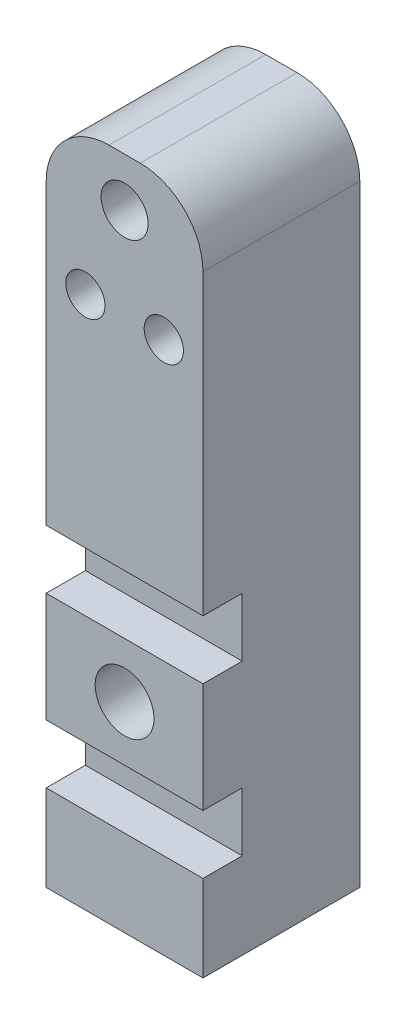
ISO-10303-21;
HEADER;
FILE_DESCRIPTION(('STEP AP214'),'2;1');
FILE_NAME('part.step','',(''),(''),'','','');
FILE_SCHEMA(('AUTOMOTIVE_DESIGN { 1 0 10303 214 1 1 1 1 }'));
ENDSEC;
DATA;
#1=APPLICATION_CONTEXT('core data for automotive mechanical design processes');
#2=APPLICATION_PROTOCOL_DEFINITION('international standard','automotive_design',2000,#1);
#3=PRODUCT_CONTEXT('',#1,'mechanical');
#4=PRODUCT('Part','Part','',(#3));
#5=PRODUCT_RELATED_PRODUCT_CATEGORY('part','',(#4));
#6=PRODUCT_DEFINITION_FORMATION('','',#4);
#7=PRODUCT_DEFINITION_CONTEXT('part definition',#1,'design');
#8=PRODUCT_DEFINITION('design','',#6,#7);
#9=PRODUCT_DEFINITION_SHAPE('','',#8);
#10=(LENGTH_UNIT() NAMED_UNIT(*) SI_UNIT(.MILLI.,.METRE.));
#11=(NAMED_UNIT(*) PLANE_ANGLE_UNIT() SI_UNIT($,.RADIAN.));
#12=(NAMED_UNIT(*) SI_UNIT($,.STERADIAN.) SOLID_ANGLE_UNIT());
#13=UNCERTAINTY_MEASURE_WITH_UNIT(LENGTH_MEASURE(1.E-05),#10,'distance_accuracy_value','');
#14=(GEOMETRIC_REPRESENTATION_CONTEXT(3) GLOBAL_UNCERTAINTY_ASSIGNED_CONTEXT((#13)) GLOBAL_UNIT_ASSIGNED_CONTEXT((#10,
#11,#12)) REPRESENTATION_CONTEXT('',''));
#15=CARTESIAN_POINT('',(0.,0.,0.));
#16=DIRECTION('',(0.,0.,1.));
#17=DIRECTION('',(1.,0.,0.));
#18=AXIS2_PLACEMENT_3D('',#15,#16,#17);
#19=CARTESIAN_POINT('',(0.,0.,7.5));
#20=DIRECTION('',(0.,0.,-1.));
#21=DIRECTION('',(-1.,0.,0.));
#22=AXIS2_PLACEMENT_3D('',#19,#20,#21);
#23=PLANE('',#22);
#24=DIRECTION('',(1.,0.,0.));
#25=VECTOR('',#24,1.);
#26=CARTESIAN_POINT('',(0.,-12.25,7.5));
#27=LINE('',#26,#25);
#28=CARTESIAN_POINT('',(-5.,-12.25,7.5));
#29=VERTEX_POINT('',#28);
#30=CARTESIAN_POINT('',(5.,-12.25,7.5));
#31=VERTEX_POINT('',#30);
#32=EDGE_CURVE('E11',#29,#31,#27,.T.);
#33=ORIENTED_EDGE('',*,*,#32,.F.);
#34=DIRECTION('',(0.,1.,0.));
#35=VECTOR('',#34,1.);
#36=CARTESIAN_POINT('',(-5.,-12.2260266892239,7.5));
#37=LINE('',#36,#35);
#38=CARTESIAN_POINT('',(-5.,-16.,7.5));
#39=VERTEX_POINT('',#38);
#40=EDGE_CURVE('E64',#39,#29,#37,.T.);
#41=ORIENTED_EDGE('',*,*,#40,.F.);
#42=DIRECTION('',(-1.,0.,0.));
#43=VECTOR('',#42,1.);
#44=CARTESIAN_POINT('',(5.,-16.,7.5));
#45=LINE('',#44,#43);
#46=CARTESIAN_POINT('',(5.,-16.,7.5));
#47=VERTEX_POINT('',#46);
#48=EDGE_CURVE('E264',#47,#39,#45,.T.);
#49=ORIENTED_EDGE('',*,*,#48,.F.);
#50=DIRECTION('',(0.,-1.,0.));
#51=VECTOR('',#50,1.);
#52=CARTESIAN_POINT('',(5.,-12.2260266892239,7.5));
#53=LINE('',#52,#51);
#54=EDGE_CURVE('E261',#31,#47,#53,.T.);
#55=ORIENTED_EDGE('',*,*,#54,.F.);
#56=EDGE_LOOP('',(#33,#41,#49,#55));
#57=FACE_BOUND('',#56,.T.);
#58=ADVANCED_FACE('F41',(#57),#23,.F.);
#59=CARTESIAN_POINT('',(0.,-16.,10.));
#60=DIRECTION('',(0.,1.,0.));
#61=DIRECTION('',(-1.,0.,0.));
#62=AXIS2_PLACEMENT_3D('',#59,#60,#61);
#63=PLANE('',#62);
#64=DIRECTION('',(0.,0.,-1.));
#65=VECTOR('',#64,1.);
#66=CARTESIAN_POINT('',(5.,-16.,10.));
#67=LINE('',#66,#65);
#68=CARTESIAN_POINT('',(5.,-16.,10.));
#69=VERTEX_POINT('',#68);
#70=EDGE_CURVE('E283',#69,#47,#67,.T.);
#71=ORIENTED_EDGE('',*,*,#70,.T.);
#72=ORIENTED_EDGE('',*,*,#48,.T.);
#73=DIRECTION('',(0.,0.,-1.));
#74=VECTOR('',#73,1.);
#75=CARTESIAN_POINT('',(-5.,-16.,10.));
#76=LINE('',#75,#74);
#77=CARTESIAN_POINT('',(-5.,-16.,10.));
#78=VERTEX_POINT('',#77);
#79=EDGE_CURVE('E50',#78,#39,#76,.T.);
#80=ORIENTED_EDGE('',*,*,#79,.F.);
#81=DIRECTION('',(1.,0.,0.));
#82=VECTOR('',#81,1.);
#83=CARTESIAN_POINT('',(0.,-16.,10.));
#84=LINE('',#83,#82);
#85=EDGE_CURVE('E268',#78,#69,#84,.T.);
#86=ORIENTED_EDGE('',*,*,#85,.T.);
#87=EDGE_LOOP('',(#71,#72,#80,#86));
#88=FACE_BOUND('',#87,.T.);
#89=ADVANCED_FACE('F43',(#88),#63,.T.);
#90=CARTESIAN_POINT('',(-5.,0.,10.));
#91=DIRECTION('',(1.,0.,0.));
#92=DIRECTION('',(0.,1.,0.));
#93=AXIS2_PLACEMENT_3D('',#90,#91,#92);
#94=PLANE('',#93);
#95=DIRECTION('',(0.,0.,-1.));
#96=VECTOR('',#95,1.);
#97=CARTESIAN_POINT('',(-5.,17.5,0.));
#98=LINE('',#97,#96);
#99=CARTESIAN_POINT('',(-5.,17.5,10.));
#100=VERTEX_POINT('',#99);
#101=CARTESIAN_POINT('',(-5.,17.5,0.));
#102=VERTEX_POINT('',#101);
#103=EDGE_CURVE('E176',#100,#102,#98,.T.);
#104=ORIENTED_EDGE('',*,*,#103,.T.);
#105=DIRECTION('',(0.,-1.,0.));
#106=VECTOR('',#105,1.);
#107=CARTESIAN_POINT('',(-5.,0.,0.));
#108=LINE('',#107,#106);
#109=CARTESIAN_POINT('',(-5.,-21.5,0.));
#110=VERTEX_POINT('',#109);
#111=EDGE_CURVE('E267',#102,#110,#108,.T.);
#112=ORIENTED_EDGE('',*,*,#111,.T.);
#113=DIRECTION('',(0.,0.,-1.));
#114=VECTOR('',#113,1.);
#115=CARTESIAN_POINT('',(-5.,-21.5,10.));
#116=LINE('',#115,#114);
#117=CARTESIAN_POINT('',(-5.,-21.5,10.));
#118=VERTEX_POINT('',#117);
#119=EDGE_CURVE('E299',#118,#110,#116,.T.);
#120=ORIENTED_EDGE('',*,*,#119,.F.);
#121=DIRECTION('',(0.,-1.,0.));
#122=VECTOR('',#121,1.);
#123=CARTESIAN_POINT('',(-5.,0.,10.));
#124=LINE('',#123,#122);
#125=EDGE_CURVE('E272',#78,#118,#124,.T.);
#126=ORIENTED_EDGE('',*,*,#125,.F.);
#127=ORIENTED_EDGE('',*,*,#79,.T.);
#128=ORIENTED_EDGE('',*,*,#40,.T.);
#129=DIRECTION('',(0.,0.,-1.));
#130=VECTOR('',#129,1.);
#131=CARTESIAN_POINT('',(-5.,-12.25,10.));
#132=LINE('',#131,#130);
#133=CARTESIAN_POINT('',(-5.,-12.25,10.));
#134=VERTEX_POINT('',#133);
#135=EDGE_CURVE('E253',#134,#29,#132,.T.);
#136=ORIENTED_EDGE('',*,*,#135,.F.);
#137=DIRECTION('',(0.,-1.,0.));
#138=VECTOR('',#137,1.);
#139=CARTESIAN_POINT('',(-5.,0.,10.));
#140=LINE('',#139,#138);
#141=CARTESIAN_POINT('',(-5.,-5.24999999999999,10.));
#142=VERTEX_POINT('',#141);
#143=EDGE_CURVE('E227',#142,#134,#140,.T.);
#144=ORIENTED_EDGE('',*,*,#143,.F.);
#145=DIRECTION('',(0.,0.,-1.));
#146=VECTOR('',#145,1.);
#147=CARTESIAN_POINT('',(-5.,-5.24999999999999,10.));
#148=LINE('',#147,#146);
#149=CARTESIAN_POINT('',(-5.,-5.24999999999999,7.5));
#150=VERTEX_POINT('',#149);
#151=EDGE_CURVE('E241',#142,#150,#148,.T.);
#152=ORIENTED_EDGE('',*,*,#151,.T.);
#153=DIRECTION('',(0.,1.,0.));
#154=VECTOR('',#153,1.);
#155=CARTESIAN_POINT('',(-5.,-1.32949915837152,7.5));
#156=LINE('',#155,#154);
#157=CARTESIAN_POINT('',(-5.,-1.49999999999999,7.5));
#158=VERTEX_POINT('',#157);
#159=EDGE_CURVE('E174',#150,#158,#156,.T.);
#160=ORIENTED_EDGE('',*,*,#159,.T.);
#161=DIRECTION('',(0.,0.,-1.));
#162=VECTOR('',#161,1.);
#163=CARTESIAN_POINT('',(-5.,-1.49999999999999,10.));
#164=LINE('',#163,#162);
#165=CARTESIAN_POINT('',(-5.,-1.49999999999999,10.));
#166=VERTEX_POINT('',#165);
#167=EDGE_CURVE('E165',#166,#158,#164,.T.);
#168=ORIENTED_EDGE('',*,*,#167,.F.);
#169=DIRECTION('',(0.,-1.,0.));
#170=VECTOR('',#169,1.);
#171=CARTESIAN_POINT('',(-5.,0.,10.));
#172=LINE('',#171,#170);
#173=EDGE_CURVE('E145',#100,#166,#172,.T.);
#174=ORIENTED_EDGE('',*,*,#173,.F.);
#175=EDGE_LOOP('',(#104,#112,#120,#126,#127,#128,#136,#144,#152,#160,#168,#174));
#176=FACE_BOUND('',#175,.T.);
#177=ADVANCED_FACE('F172',(#176),#94,.F.);
#178=CARTESIAN_POINT('',(0.,-21.5,10.));
#179=DIRECTION('',(0.,1.,0.));
#180=DIRECTION('',(0.,0.,1.));
#181=AXIS2_PLACEMENT_3D('',#178,#179,#180);
#182=PLANE('',#181);
#183=CARTESIAN_POINT('',(0.,-21.5,5.));
#184=DIRECTION('',(0.,-1.,0.));
#185=DIRECTION('',(0.,0.,-1.));
#186=AXIS2_PLACEMENT_3D('',#183,#184,#185);
#187=CIRCLE('',#186,1.);
#188=CARTESIAN_POINT('',(0.,-21.5,4.));
#189=VERTEX_POINT('',#188);
#190=EDGE_CURVE('E602',#189,#189,#187,.T.);
#191=ORIENTED_EDGE('',*,*,#190,.F.);
#192=EDGE_LOOP('',(#191));
#193=FACE_BOUND('',#192,.T.);
#194=DIRECTION('',(1.,0.,0.));
#195=VECTOR('',#194,1.);
#196=CARTESIAN_POINT('',(0.,-21.5,0.));
#197=LINE('',#196,#195);
#198=CARTESIAN_POINT('',(5.,-21.5,0.));
#199=VERTEX_POINT('',#198);
#200=EDGE_CURVE('E286',#110,#199,#197,.T.);
#201=ORIENTED_EDGE('',*,*,#200,.T.);
#202=DIRECTION('',(0.,0.,-1.));
#203=VECTOR('',#202,1.);
#204=CARTESIAN_POINT('',(5.,-21.5,10.));
#205=LINE('',#204,#203);
#206=CARTESIAN_POINT('',(5.,-21.5,10.));
#207=VERTEX_POINT('',#206);
#208=EDGE_CURVE('E295',#207,#199,#205,.T.);
#209=ORIENTED_EDGE('',*,*,#208,.F.);
#210=DIRECTION('',(1.,0.,0.));
#211=VECTOR('',#210,1.);
#212=CARTESIAN_POINT('',(0.,-21.5,10.));
#213=LINE('',#212,#211);
#214=EDGE_CURVE('E276',#118,#207,#213,.T.);
#215=ORIENTED_EDGE('',*,*,#214,.F.);
#216=ORIENTED_EDGE('',*,*,#119,.T.);
#217=EDGE_LOOP('',(#201,#209,#215,#216));
#218=FACE_BOUND('',#217,.T.);
#219=ADVANCED_FACE('F317',(#193,#218),#182,.F.);
#220=CARTESIAN_POINT('',(5.,0.,10.));
#221=DIRECTION('',(1.,0.,0.));
#222=DIRECTION('',(0.,1.,0.));
#223=AXIS2_PLACEMENT_3D('',#220,#221,#222);
#224=PLANE('',#223);
#225=DIRECTION('',(0.,-1.,0.));
#226=VECTOR('',#225,1.);
#227=CARTESIAN_POINT('',(5.,0.,0.));
#228=LINE('',#227,#226);
#229=CARTESIAN_POINT('',(5.,17.5,0.));
#230=VERTEX_POINT('',#229);
#231=EDGE_CURVE('E273',#230,#199,#228,.T.);
#232=ORIENTED_EDGE('',*,*,#231,.F.);
#233=DIRECTION('',(0.,0.,-1.));
#234=VECTOR('',#233,1.);
#235=CARTESIAN_POINT('',(5.,17.5,10.));
#236=LINE('',#235,#234);
#237=CARTESIAN_POINT('',(5.,17.5,10.));
#238=VERTEX_POINT('',#237);
#239=EDGE_CURVE('E204',#230,#238,#236,.F.);
#240=ORIENTED_EDGE('',*,*,#239,.T.);
#241=DIRECTION('',(0.,-1.,0.));
#242=VECTOR('',#241,1.);
#243=CARTESIAN_POINT('',(5.,0.,10.));
#244=LINE('',#243,#242);
#245=CARTESIAN_POINT('',(5.,-1.49999999999999,10.));
#246=VERTEX_POINT('',#245);
#247=EDGE_CURVE('E169',#238,#246,#244,.T.);
#248=ORIENTED_EDGE('',*,*,#247,.T.);
#249=DIRECTION('',(0.,0.,-1.));
#250=VECTOR('',#249,1.);
#251=CARTESIAN_POINT('',(5.,-1.49999999999999,10.));
#252=LINE('',#251,#250);
#253=CARTESIAN_POINT('',(5.,-1.49999999999999,7.5));
#254=VERTEX_POINT('',#253);
#255=EDGE_CURVE('E167',#246,#254,#252,.T.);
#256=ORIENTED_EDGE('',*,*,#255,.T.);
#257=DIRECTION('',(0.,-1.,0.));
#258=VECTOR('',#257,1.);
#259=CARTESIAN_POINT('',(5.,-1.32949915837152,7.5));
#260=LINE('',#259,#258);
#261=CARTESIAN_POINT('',(5.,-5.24999999999999,7.5));
#262=VERTEX_POINT('',#261);
#263=EDGE_CURVE('E215',#254,#262,#260,.T.);
#264=ORIENTED_EDGE('',*,*,#263,.T.);
#265=DIRECTION('',(0.,0.,-1.));
#266=VECTOR('',#265,1.);
#267=CARTESIAN_POINT('',(5.,-5.24999999999999,10.));
#268=LINE('',#267,#266);
#269=CARTESIAN_POINT('',(5.,-5.24999999999999,10.));
#270=VERTEX_POINT('',#269);
#271=EDGE_CURVE('E247',#270,#262,#268,.T.);
#272=ORIENTED_EDGE('',*,*,#271,.F.);
#273=DIRECTION('',(0.,-1.,0.));
#274=VECTOR('',#273,1.);
#275=CARTESIAN_POINT('',(5.,0.,10.));
#276=LINE('',#275,#274);
#277=CARTESIAN_POINT('',(5.,-12.25,10.));
#278=VERTEX_POINT('',#277);
#279=EDGE_CURVE('E234',#270,#278,#276,.T.);
#280=ORIENTED_EDGE('',*,*,#279,.T.);
#281=DIRECTION('',(0.,0.,-1.));
#282=VECTOR('',#281,1.);
#283=CARTESIAN_POINT('',(5.,-12.25,10.));
#284=LINE('',#283,#282);
#285=EDGE_CURVE('E57',#278,#31,#284,.T.);
#286=ORIENTED_EDGE('',*,*,#285,.T.);
#287=ORIENTED_EDGE('',*,*,#54,.T.);
#288=ORIENTED_EDGE('',*,*,#70,.F.);
#289=DIRECTION('',(0.,-1.,0.));
#290=VECTOR('',#289,1.);
#291=CARTESIAN_POINT('',(5.,0.,10.));
#292=LINE('',#291,#290);
#293=EDGE_CURVE('E279',#69,#207,#292,.T.);
#294=ORIENTED_EDGE('',*,*,#293,.T.);
#295=ORIENTED_EDGE('',*,*,#208,.T.);
#296=EDGE_LOOP('',(#232,#240,#248,#256,#264,#272,#280,#286,#287,#288,#294,#295));
#297=FACE_BOUND('',#296,.T.);
#298=ADVANCED_FACE('F311',(#297),#224,.T.);
#299=CARTESIAN_POINT('',(0.,0.,10.));
#300=DIRECTION('',(0.,0.,1.));
#301=DIRECTION('',(1.,0.,0.));
#302=AXIS2_PLACEMENT_3D('',#299,#300,#301);
#303=PLANE('',#302);
#304=ORIENTED_EDGE('',*,*,#85,.F.);
#305=ORIENTED_EDGE('',*,*,#125,.T.);
#306=ORIENTED_EDGE('',*,*,#214,.T.);
#307=ORIENTED_EDGE('',*,*,#293,.F.);
#308=EDGE_LOOP('',(#304,#305,#306,#307));
#309=FACE_BOUND('',#308,.T.);
#310=ADVANCED_FACE('F314',(#309),#303,.T.);
#311=CARTESIAN_POINT('',(0.,0.,0.));
#312=DIRECTION('',(0.,0.,1.));
#313=DIRECTION('',(1.,0.,0.));
#314=AXIS2_PLACEMENT_3D('',#311,#312,#313);
#315=PLANE('',#314);
#316=ORIENTED_EDGE('',*,*,#231,.T.);
#317=ORIENTED_EDGE('',*,*,#200,.F.);
#318=ORIENTED_EDGE('',*,*,#111,.F.);
#319=CARTESIAN_POINT('',(-1.,17.5,0.));
#320=DIRECTION('',(0.,0.,1.));
#321=DIRECTION('',(1.,0.,0.));
#322=AXIS2_PLACEMENT_3D('',#319,#320,#321);
#323=CIRCLE('',#322,4.);
#324=CARTESIAN_POINT('',(-1.,21.5,0.));
#325=VERTEX_POINT('',#324);
#326=EDGE_CURVE('E189',#102,#325,#323,.F.);
#327=ORIENTED_EDGE('',*,*,#326,.T.);
#328=DIRECTION('',(1.,0.,0.));
#329=VECTOR('',#328,1.);
#330=CARTESIAN_POINT('',(0.,21.5,0.));
#331=LINE('',#330,#329);
#332=CARTESIAN_POINT('',(0.999999999999998,21.5,0.));
#333=VERTEX_POINT('',#332);
#334=EDGE_CURVE('E211',#325,#333,#331,.T.);
#335=ORIENTED_EDGE('',*,*,#334,.T.);
#336=CARTESIAN_POINT('',(0.999999999999998,17.5,0.));
#337=DIRECTION('',(0.,0.,1.));
#338=DIRECTION('',(1.,0.,0.));
#339=AXIS2_PLACEMENT_3D('',#336,#337,#338);
#340=CIRCLE('',#339,4.);
#341=EDGE_CURVE('E180',#333,#230,#340,.F.);
#342=ORIENTED_EDGE('',*,*,#341,.T.);
#343=EDGE_LOOP('',(#316,#317,#318,#327,#335,#342));
#344=FACE_BOUND('',#343,.T.);
#345=CARTESIAN_POINT('',(-2.5,12.5,0.));
#346=DIRECTION('',(0.,0.,1.));
#347=DIRECTION('',(1.,0.,0.));
#348=AXIS2_PLACEMENT_3D('',#345,#346,#347);
#349=CIRCLE('',#348,1.25);
#350=CARTESIAN_POINT('',(-1.25,12.5,0.));
#351=VERTEX_POINT('',#350);
#352=EDGE_CURVE('E338',#351,#351,#349,.T.);
#353=ORIENTED_EDGE('',*,*,#352,.T.);
#354=EDGE_LOOP('',(#353));
#355=FACE_BOUND('',#354,.T.);
#356=CARTESIAN_POINT('',(2.5,12.5,0.));
#357=DIRECTION('',(0.,0.,1.));
#358=DIRECTION('',(1.,0.,0.));
#359=AXIS2_PLACEMENT_3D('',#356,#357,#358);
#360=CIRCLE('',#359,1.25);
#361=CARTESIAN_POINT('',(3.75,12.5,0.));
#362=VERTEX_POINT('',#361);
#363=EDGE_CURVE('E160',#362,#362,#360,.F.);
#364=ORIENTED_EDGE('',*,*,#363,.F.);
#365=EDGE_LOOP('',(#364));
#366=FACE_BOUND('',#365,.T.);
#367=CARTESIAN_POINT('',(0.,-8.74999999999999,0.));
#368=DIRECTION('',(0.,0.,1.));
#369=DIRECTION('',(1.,0.,0.));
#370=AXIS2_PLACEMENT_3D('',#367,#368,#369);
#371=CIRCLE('',#370,1.875);
#372=CARTESIAN_POINT('',(1.875,-8.74999999999999,0.));
#373=VERTEX_POINT('',#372);
#374=EDGE_CURVE('E222',#373,#373,#371,.T.);
#375=ORIENTED_EDGE('',*,*,#374,.T.);
#376=EDGE_LOOP('',(#375));
#377=FACE_BOUND('',#376,.T.);
#378=ADVANCED_FACE('F320',(#344,#355,#366,#377),#315,.F.);
#379=CARTESIAN_POINT('',(0.,-12.25,10.));
#380=DIRECTION('',(0.,1.,0.));
#381=DIRECTION('',(-1.,0.,0.));
#382=AXIS2_PLACEMENT_3D('',#379,#380,#381);
#383=PLANE('',#382);
#384=ORIENTED_EDGE('',*,*,#135,.T.);
#385=ORIENTED_EDGE('',*,*,#32,.T.);
#386=ORIENTED_EDGE('',*,*,#285,.F.);
#387=DIRECTION('',(1.,0.,0.));
#388=VECTOR('',#387,1.);
#389=CARTESIAN_POINT('',(0.,-12.25,10.));
#390=LINE('',#389,#388);
#391=EDGE_CURVE('E231',#134,#278,#390,.T.);
#392=ORIENTED_EDGE('',*,*,#391,.F.);
#393=EDGE_LOOP('',(#384,#385,#386,#392));
#394=FACE_BOUND('',#393,.T.);
#395=ADVANCED_FACE('F353',(#394),#383,.F.);
#396=CARTESIAN_POINT('',(0.,0.,7.5));
#397=DIRECTION('',(0.,0.,-1.));
#398=DIRECTION('',(-1.,0.,0.));
#399=AXIS2_PLACEMENT_3D('',#396,#397,#398);
#400=PLANE('',#399);
#401=DIRECTION('',(1.,0.,0.));
#402=VECTOR('',#401,1.);
#403=CARTESIAN_POINT('',(0.,-1.49999999999999,7.5));
#404=LINE('',#403,#402);
#405=EDGE_CURVE('E256',#158,#254,#404,.T.);
#406=ORIENTED_EDGE('',*,*,#405,.F.);
#407=ORIENTED_EDGE('',*,*,#159,.F.);
#408=DIRECTION('',(-1.,0.,0.));
#409=VECTOR('',#408,1.);
#410=CARTESIAN_POINT('',(5.,-5.24999999999999,7.5));
#411=LINE('',#410,#409);
#412=EDGE_CURVE('E218',#262,#150,#411,.T.);
#413=ORIENTED_EDGE('',*,*,#412,.F.);
#414=ORIENTED_EDGE('',*,*,#263,.F.);
#415=EDGE_LOOP('',(#406,#407,#413,#414));
#416=FACE_BOUND('',#415,.T.);
#417=ADVANCED_FACE('F369',(#416),#400,.F.);
#418=CARTESIAN_POINT('',(0.,-5.24999999999999,10.));
#419=DIRECTION('',(0.,1.,0.));
#420=DIRECTION('',(0.,0.,1.));
#421=AXIS2_PLACEMENT_3D('',#418,#419,#420);
#422=PLANE('',#421);
#423=ORIENTED_EDGE('',*,*,#271,.T.);
#424=ORIENTED_EDGE('',*,*,#412,.T.);
#425=ORIENTED_EDGE('',*,*,#151,.F.);
#426=DIRECTION('',(1.,0.,0.));
#427=VECTOR('',#426,1.);
#428=CARTESIAN_POINT('',(0.,-5.24999999999999,10.));
#429=LINE('',#428,#427);
#430=EDGE_CURVE('E237',#142,#270,#429,.T.);
#431=ORIENTED_EDGE('',*,*,#430,.T.);
#432=EDGE_LOOP('',(#423,#424,#425,#431));
#433=FACE_BOUND('',#432,.T.);
#434=ADVANCED_FACE('F360',(#433),#422,.T.);
#435=CARTESIAN_POINT('',(0.,-8.74999999999999,10.));
#436=DIRECTION('',(0.,0.,-1.));
#437=DIRECTION('',(-1.,0.,0.));
#438=AXIS2_PLACEMENT_3D('',#435,#436,#437);
#439=CYLINDRICAL_SURFACE('',#438,1.875);
#440=CARTESIAN_POINT('',(0.,-8.74999999999999,10.));
#441=DIRECTION('',(0.,0.,1.));
#442=DIRECTION('',(1.,0.,0.));
#443=AXIS2_PLACEMENT_3D('',#440,#441,#442);
#444=CIRCLE('',#443,1.875);
#445=CARTESIAN_POINT('',(1.875,-8.74999999999999,10.));
#446=VERTEX_POINT('',#445);
#447=EDGE_CURVE('E223',#446,#446,#444,.T.);
#448=ORIENTED_EDGE('',*,*,#447,.T.);
#449=EDGE_LOOP('',(#448));
#450=FACE_BOUND('',#449,.T.);
#451=ORIENTED_EDGE('',*,*,#374,.F.);
#452=EDGE_LOOP('',(#451));
#453=FACE_BOUND('',#452,.T.);
#454=ADVANCED_FACE('F357',(#450,#453),#439,.F.);
#455=CARTESIAN_POINT('',(0.,0.,10.));
#456=DIRECTION('',(0.,0.,1.));
#457=DIRECTION('',(1.,0.,0.));
#458=AXIS2_PLACEMENT_3D('',#455,#456,#457);
#459=PLANE('',#458);
#460=ORIENTED_EDGE('',*,*,#447,.F.);
#461=EDGE_LOOP('',(#460));
#462=FACE_BOUND('',#461,.T.);
#463=ORIENTED_EDGE('',*,*,#143,.T.);
#464=ORIENTED_EDGE('',*,*,#391,.T.);
#465=ORIENTED_EDGE('',*,*,#279,.F.);
#466=ORIENTED_EDGE('',*,*,#430,.F.);
#467=EDGE_LOOP('',(#463,#464,#465,#466));
#468=FACE_BOUND('',#467,.T.);
#469=ADVANCED_FACE('F359',(#462,#468),#459,.T.);
#470=CARTESIAN_POINT('',(0.,-1.49999999999999,10.));
#471=DIRECTION('',(0.,1.,0.));
#472=DIRECTION('',(0.,0.,1.));
#473=AXIS2_PLACEMENT_3D('',#470,#471,#472);
#474=PLANE('',#473);
#475=ORIENTED_EDGE('',*,*,#167,.T.);
#476=ORIENTED_EDGE('',*,*,#405,.T.);
#477=ORIENTED_EDGE('',*,*,#255,.F.);
#478=DIRECTION('',(1.,0.,0.));
#479=VECTOR('',#478,1.);
#480=CARTESIAN_POINT('',(0.,-1.49999999999999,10.));
#481=LINE('',#480,#479);
#482=EDGE_CURVE('E151',#166,#246,#481,.T.);
#483=ORIENTED_EDGE('',*,*,#482,.F.);
#484=EDGE_LOOP('',(#475,#476,#477,#483));
#485=FACE_BOUND('',#484,.T.);
#486=ADVANCED_FACE('F163',(#485),#474,.F.);
#487=CARTESIAN_POINT('',(0.,18.4,10.));
#488=DIRECTION('',(0.,0.,-1.));
#489=DIRECTION('',(-1.,0.,0.));
#490=AXIS2_PLACEMENT_3D('',#487,#488,#489);
#491=CYLINDRICAL_SURFACE('',#490,1.5);
#492=CARTESIAN_POINT('',(0.,18.4,10.));
#493=DIRECTION('',(0.,0.,1.));
#494=DIRECTION('',(1.,0.,0.));
#495=AXIS2_PLACEMENT_3D('',#492,#493,#494);
#496=CIRCLE('',#495,1.5);
#497=CARTESIAN_POINT('',(1.5,18.4,10.));
#498=VERTEX_POINT('',#497);
#499=EDGE_CURVE('E610',#498,#498,#496,.T.);
#500=ORIENTED_EDGE('',*,*,#499,.T.);
#501=EDGE_LOOP('',(#500));
#502=FACE_BOUND('',#501,.T.);
#503=CARTESIAN_POINT('',(0.,18.4,3.5));
#504=DIRECTION('',(0.,0.,-1.));
#505=DIRECTION('',(-1.,0.,0.));
#506=AXIS2_PLACEMENT_3D('',#503,#504,#505);
#507=CIRCLE('',#506,1.5);
#508=CARTESIAN_POINT('',(-1.5,18.4,3.5));
#509=VERTEX_POINT('',#508);
#510=EDGE_CURVE('E207',#509,#509,#507,.T.);
#511=ORIENTED_EDGE('',*,*,#510,.T.);
#512=EDGE_LOOP('',(#511));
#513=FACE_BOUND('',#512,.T.);
#514=ADVANCED_FACE('F444',(#502,#513),#491,.F.);
#515=CARTESIAN_POINT('',(-2.5,12.5,10.));
#516=DIRECTION('',(0.,0.,-1.));
#517=DIRECTION('',(-1.,0.,0.));
#518=AXIS2_PLACEMENT_3D('',#515,#516,#517);
#519=CYLINDRICAL_SURFACE('',#518,1.25);
#520=CARTESIAN_POINT('',(-2.5,12.5,10.));
#521=DIRECTION('',(0.,0.,1.));
#522=DIRECTION('',(1.,0.,0.));
#523=AXIS2_PLACEMENT_3D('',#520,#521,#522);
#524=CIRCLE('',#523,1.25);
#525=CARTESIAN_POINT('',(-1.25,12.5,10.));
#526=VERTEX_POINT('',#525);
#527=EDGE_CURVE('E613',#526,#526,#524,.T.);
#528=ORIENTED_EDGE('',*,*,#527,.T.);
#529=EDGE_LOOP('',(#528));
#530=FACE_BOUND('',#529,.T.);
#531=ORIENTED_EDGE('',*,*,#352,.F.);
#532=EDGE_LOOP('',(#531));
#533=FACE_BOUND('',#532,.T.);
#534=ADVANCED_FACE('F453',(#530,#533),#519,.F.);
#535=CARTESIAN_POINT('',(0.,21.5,10.));
#536=DIRECTION('',(0.,1.,0.));
#537=DIRECTION('',(0.,0.,1.));
#538=AXIS2_PLACEMENT_3D('',#535,#536,#537);
#539=PLANE('',#538);
#540=ORIENTED_EDGE('',*,*,#334,.F.);
#541=DIRECTION('',(0.,0.,-1.));
#542=VECTOR('',#541,1.);
#543=CARTESIAN_POINT('',(-1.,21.5,10.));
#544=LINE('',#543,#542);
#545=CARTESIAN_POINT('',(-1.,21.5,10.));
#546=VERTEX_POINT('',#545);
#547=EDGE_CURVE('E196',#325,#546,#544,.F.);
#548=ORIENTED_EDGE('',*,*,#547,.T.);
#549=DIRECTION('',(1.,0.,0.));
#550=VECTOR('',#549,1.);
#551=CARTESIAN_POINT('',(0.,21.5,10.));
#552=LINE('',#551,#550);
#553=CARTESIAN_POINT('',(0.999999999999998,21.5,10.));
#554=VERTEX_POINT('',#553);
#555=EDGE_CURVE('E329',#546,#554,#552,.T.);
#556=ORIENTED_EDGE('',*,*,#555,.T.);
#557=DIRECTION('',(0.,0.,-1.));
#558=VECTOR('',#557,1.);
#559=CARTESIAN_POINT('',(0.999999999999998,21.5,10.));
#560=LINE('',#559,#558);
#561=EDGE_CURVE('E192',#554,#333,#560,.T.);
#562=ORIENTED_EDGE('',*,*,#561,.T.);
#563=EDGE_LOOP('',(#540,#548,#556,#562));
#564=FACE_BOUND('',#563,.T.);
#565=ADVANCED_FACE('F335',(#564),#539,.T.);
#566=CARTESIAN_POINT('',(2.5,12.5,10.));
#567=DIRECTION('',(0.,0.,-1.));
#568=DIRECTION('',(-1.,0.,0.));
#569=AXIS2_PLACEMENT_3D('',#566,#567,#568);
#570=CYLINDRICAL_SURFACE('',#569,1.25);
#571=CARTESIAN_POINT('',(2.5,12.5,10.));
#572=DIRECTION('',(0.,0.,1.));
#573=DIRECTION('',(1.,0.,0.));
#574=AXIS2_PLACEMENT_3D('',#571,#572,#573);
#575=CIRCLE('',#574,1.25);
#576=CARTESIAN_POINT('',(3.75,12.5,10.));
#577=VERTEX_POINT('',#576);
#578=EDGE_CURVE('E182',#577,#577,#575,.F.);
#579=ORIENTED_EDGE('',*,*,#578,.F.);
#580=EDGE_LOOP('',(#579));
#581=FACE_BOUND('',#580,.T.);
#582=ORIENTED_EDGE('',*,*,#363,.T.);
#583=EDGE_LOOP('',(#582));
#584=FACE_BOUND('',#583,.T.);
#585=ADVANCED_FACE('F349',(#581,#584),#570,.F.);
#586=CARTESIAN_POINT('',(0.,0.,10.));
#587=DIRECTION('',(0.,0.,1.));
#588=DIRECTION('',(1.,0.,0.));
#589=AXIS2_PLACEMENT_3D('',#586,#587,#588);
#590=PLANE('',#589);
#591=ORIENTED_EDGE('',*,*,#555,.F.);
#592=CARTESIAN_POINT('',(-1.,17.5,10.));
#593=DIRECTION('',(0.,0.,1.));
#594=DIRECTION('',(1.,0.,0.));
#595=AXIS2_PLACEMENT_3D('',#592,#593,#594);
#596=CIRCLE('',#595,4.);
#597=EDGE_CURVE('E154',#546,#100,#596,.T.);
#598=ORIENTED_EDGE('',*,*,#597,.T.);
#599=ORIENTED_EDGE('',*,*,#173,.T.);
#600=ORIENTED_EDGE('',*,*,#482,.T.);
#601=ORIENTED_EDGE('',*,*,#247,.F.);
#602=CARTESIAN_POINT('',(0.999999999999998,17.5,10.));
#603=DIRECTION('',(0.,0.,1.));
#604=DIRECTION('',(1.,0.,0.));
#605=AXIS2_PLACEMENT_3D('',#602,#603,#604);
#606=CIRCLE('',#605,4.);
#607=EDGE_CURVE('E199',#238,#554,#606,.T.);
#608=ORIENTED_EDGE('',*,*,#607,.T.);
#609=EDGE_LOOP('',(#591,#598,#599,#600,#601,#608));
#610=FACE_BOUND('',#609,.T.);
#611=ORIENTED_EDGE('',*,*,#499,.F.);
#612=EDGE_LOOP('',(#611));
#613=FACE_BOUND('',#612,.T.);
#614=ORIENTED_EDGE('',*,*,#527,.F.);
#615=EDGE_LOOP('',(#614));
#616=FACE_BOUND('',#615,.T.);
#617=ORIENTED_EDGE('',*,*,#578,.T.);
#618=EDGE_LOOP('',(#617));
#619=FACE_BOUND('',#618,.T.);
#620=ADVANCED_FACE('F148',(#610,#613,#616,#619),#590,.T.);
#621=CARTESIAN_POINT('',(-1.,17.5,10.));
#622=DIRECTION('',(0.,0.,1.));
#623=DIRECTION('',(1.,0.,0.));
#624=AXIS2_PLACEMENT_3D('',#621,#622,#623);
#625=CYLINDRICAL_SURFACE('',#624,4.);
#626=ORIENTED_EDGE('',*,*,#597,.F.);
#627=ORIENTED_EDGE('',*,*,#547,.F.);
#628=ORIENTED_EDGE('',*,*,#326,.F.);
#629=ORIENTED_EDGE('',*,*,#103,.F.);
#630=EDGE_LOOP('',(#626,#627,#628,#629));
#631=FACE_BOUND('',#630,.T.);
#632=ADVANCED_FACE('F489',(#631),#625,.T.);
#633=CARTESIAN_POINT('',(0.999999999999998,17.5,10.));
#634=DIRECTION('',(0.,0.,-1.));
#635=DIRECTION('',(-1.,0.,0.));
#636=AXIS2_PLACEMENT_3D('',#633,#634,#635);
#637=CYLINDRICAL_SURFACE('',#636,4.);
#638=ORIENTED_EDGE('',*,*,#607,.F.);
#639=ORIENTED_EDGE('',*,*,#239,.F.);
#640=ORIENTED_EDGE('',*,*,#341,.F.);
#641=ORIENTED_EDGE('',*,*,#561,.F.);
#642=EDGE_LOOP('',(#638,#639,#640,#641));
#643=FACE_BOUND('',#642,.T.);
#644=ADVANCED_FACE('F332',(#643),#637,.T.);
#645=CARTESIAN_POINT('',(0.,18.4,3.5));
#646=DIRECTION('',(0.,0.,-1.));
#647=DIRECTION('',(-1.,0.,0.));
#648=AXIS2_PLACEMENT_3D('',#645,#646,#647);
#649=PLANE('',#648);
#650=ORIENTED_EDGE('',*,*,#510,.F.);
#651=EDGE_LOOP('',(#650));
#652=FACE_BOUND('',#651,.T.);
#653=ADVANCED_FACE('F506',(#652),#649,.F.);
#654=CARTESIAN_POINT('',(0.,-14.5,5.));
#655=DIRECTION('',(0.,-1.,0.));
#656=DIRECTION('',(0.,0.,-1.));
#657=AXIS2_PLACEMENT_3D('',#654,#655,#656);
#658=CYLINDRICAL_SURFACE('',#657,1.);
#659=CARTESIAN_POINT('',(0.,-14.5,5.));
#660=DIRECTION('',(0.,-1.,0.));
#661=DIRECTION('',(0.,0.,-1.));
#662=AXIS2_PLACEMENT_3D('',#659,#660,#661);
#663=CIRCLE('',#662,1.);
#664=CARTESIAN_POINT('',(0.,-14.5,4.));
#665=VERTEX_POINT('',#664);
#666=EDGE_CURVE('E212',#665,#665,#663,.T.);
#667=ORIENTED_EDGE('',*,*,#666,.F.);
#668=EDGE_LOOP('',(#667));
#669=FACE_BOUND('',#668,.T.);
#670=ORIENTED_EDGE('',*,*,#190,.T.);
#671=EDGE_LOOP('',(#670));
#672=FACE_BOUND('',#671,.T.);
#673=ADVANCED_FACE('F514',(#669,#672),#658,.F.);
#674=CARTESIAN_POINT('',(0.,-14.5,5.));
#675=DIRECTION('',(0.,-1.,0.));
#676=DIRECTION('',(0.,0.,-1.));
#677=AXIS2_PLACEMENT_3D('',#674,#675,#676);
#678=PLANE('',#677);
#679=ORIENTED_EDGE('',*,*,#666,.T.);
#680=EDGE_LOOP('',(#679));
#681=FACE_BOUND('',#680,.T.);
#682=ADVANCED_FACE('F524',(#681),#678,.T.);
#683=CLOSED_SHELL('',(#58,#89,#177,#219,#298,#310,#378,#395,#417,#434,#454,#469,#486,#514,#534,
#565,#585,#620,#632,#644,#653,#673,#682));
#684=MANIFOLD_SOLID_BREP('B2',#683);
#685=ADVANCED_BREP_SHAPE_REPRESENTATION('',(#18,#684),#14);
#686=SHAPE_DEFINITION_REPRESENTATION(#9,#685);
ENDSEC;
END-ISO-10303-21;
